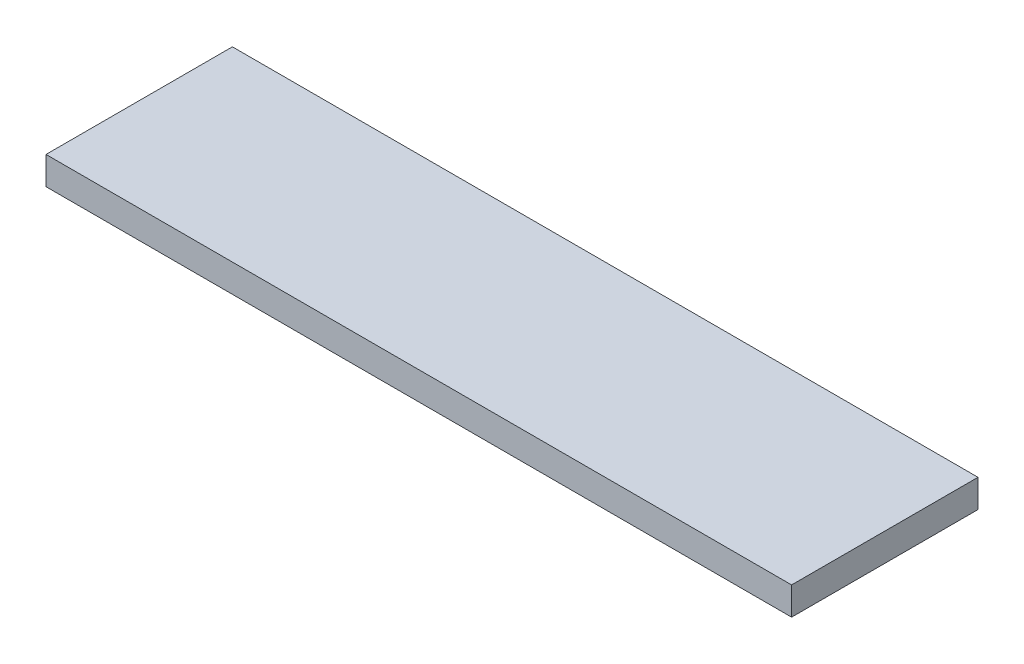
ISO-10303-21;
HEADER;
FILE_DESCRIPTION(('STEP AP214'),'2;1');
FILE_NAME('part.step','',(''),(''),'','','');
FILE_SCHEMA(('AUTOMOTIVE_DESIGN { 1 0 10303 214 1 1 1 1 }'));
ENDSEC;
DATA;
#1=APPLICATION_CONTEXT('core data for automotive mechanical design processes');
#2=APPLICATION_PROTOCOL_DEFINITION('international standard','automotive_design',2000,#1);
#3=PRODUCT_CONTEXT('',#1,'mechanical');
#4=PRODUCT('Part','Part','',(#3));
#5=PRODUCT_RELATED_PRODUCT_CATEGORY('part','',(#4));
#6=PRODUCT_DEFINITION_FORMATION('','',#4);
#7=PRODUCT_DEFINITION_CONTEXT('part definition',#1,'design');
#8=PRODUCT_DEFINITION('design','',#6,#7);
#9=PRODUCT_DEFINITION_SHAPE('','',#8);
#10=(LENGTH_UNIT() NAMED_UNIT(*) SI_UNIT(.MILLI.,.METRE.));
#11=(NAMED_UNIT(*) PLANE_ANGLE_UNIT() SI_UNIT($,.RADIAN.));
#12=(NAMED_UNIT(*) SI_UNIT($,.STERADIAN.) SOLID_ANGLE_UNIT());
#13=UNCERTAINTY_MEASURE_WITH_UNIT(LENGTH_MEASURE(1.E-05),#10,'distance_accuracy_value','');
#14=(GEOMETRIC_REPRESENTATION_CONTEXT(3) GLOBAL_UNCERTAINTY_ASSIGNED_CONTEXT((#13)) GLOBAL_UNIT_ASSIGNED_CONTEXT((#10,
#11,#12)) REPRESENTATION_CONTEXT('',''));
#15=CARTESIAN_POINT('',(0.,0.,0.));
#16=DIRECTION('',(0.,0.,1.));
#17=DIRECTION('',(1.,0.,0.));
#18=AXIS2_PLACEMENT_3D('',#15,#16,#17);
#19=CARTESIAN_POINT('',(0.,15.,0.));
#20=DIRECTION('',(1.,0.,0.));
#21=DIRECTION('',(0.,0.,-1.));
#22=AXIS2_PLACEMENT_3D('',#19,#20,#21);
#23=PLANE('',#22);
#24=DIRECTION('',(0.,0.,1.));
#25=VECTOR('',#24,1.);
#26=CARTESIAN_POINT('',(0.,0.,0.));
#27=LINE('',#26,#25);
#28=CARTESIAN_POINT('',(0.,0.,-100.));
#29=VERTEX_POINT('',#28);
#30=CARTESIAN_POINT('',(0.,0.,0.));
#31=VERTEX_POINT('',#30);
#32=EDGE_CURVE('E104',#29,#31,#27,.T.);
#33=ORIENTED_EDGE('',*,*,#32,.T.);
#34=DIRECTION('',(0.,-1.,0.));
#35=VECTOR('',#34,1.);
#36=CARTESIAN_POINT('',(0.,15.,0.));
#37=LINE('',#36,#35);
#38=CARTESIAN_POINT('',(0.,15.,0.));
#39=VERTEX_POINT('',#38);
#40=EDGE_CURVE('E11',#39,#31,#37,.T.);
#41=ORIENTED_EDGE('',*,*,#40,.F.);
#42=DIRECTION('',(0.,0.,1.));
#43=VECTOR('',#42,1.);
#44=CARTESIAN_POINT('',(0.,15.,0.));
#45=LINE('',#44,#43);
#46=CARTESIAN_POINT('',(0.,15.,-100.));
#47=VERTEX_POINT('',#46);
#48=EDGE_CURVE('E92',#47,#39,#45,.T.);
#49=ORIENTED_EDGE('',*,*,#48,.F.);
#50=DIRECTION('',(0.,-1.,0.));
#51=VECTOR('',#50,1.);
#52=CARTESIAN_POINT('',(0.,15.,-100.));
#53=LINE('',#52,#51);
#54=EDGE_CURVE('E100',#47,#29,#53,.T.);
#55=ORIENTED_EDGE('',*,*,#54,.T.);
#56=EDGE_LOOP('',(#33,#41,#49,#55));
#57=FACE_BOUND('',#56,.T.);
#58=ADVANCED_FACE('F41',(#57),#23,.F.);
#59=CARTESIAN_POINT('',(0.,15.,0.));
#60=DIRECTION('',(0.,0.,-1.));
#61=DIRECTION('',(-1.,0.,0.));
#62=AXIS2_PLACEMENT_3D('',#59,#60,#61);
#63=PLANE('',#62);
#64=DIRECTION('',(1.,0.,0.));
#65=VECTOR('',#64,1.);
#66=CARTESIAN_POINT('',(0.,0.,0.));
#67=LINE('',#66,#65);
#68=CARTESIAN_POINT('',(400.,0.,0.));
#69=VERTEX_POINT('',#68);
#70=EDGE_CURVE('E96',#31,#69,#67,.T.);
#71=ORIENTED_EDGE('',*,*,#70,.T.);
#72=DIRECTION('',(0.,-1.,0.));
#73=VECTOR('',#72,1.);
#74=CARTESIAN_POINT('',(400.,15.,0.));
#75=LINE('',#74,#73);
#76=CARTESIAN_POINT('',(400.,15.,0.));
#77=VERTEX_POINT('',#76);
#78=EDGE_CURVE('E49',#77,#69,#75,.T.);
#79=ORIENTED_EDGE('',*,*,#78,.F.);
#80=DIRECTION('',(1.,0.,0.));
#81=VECTOR('',#80,1.);
#82=CARTESIAN_POINT('',(0.,15.,0.));
#83=LINE('',#82,#81);
#84=EDGE_CURVE('E87',#39,#77,#83,.T.);
#85=ORIENTED_EDGE('',*,*,#84,.F.);
#86=ORIENTED_EDGE('',*,*,#40,.T.);
#87=EDGE_LOOP('',(#71,#79,#85,#86));
#88=FACE_BOUND('',#87,.T.);
#89=ADVANCED_FACE('F95',(#88),#63,.F.);
#90=CARTESIAN_POINT('',(400.,15.,0.));
#91=DIRECTION('',(-1.,0.,0.));
#92=DIRECTION('',(0.,0.,1.));
#93=AXIS2_PLACEMENT_3D('',#90,#91,#92);
#94=PLANE('',#93);
#95=DIRECTION('',(0.,0.,-1.));
#96=VECTOR('',#95,1.);
#97=CARTESIAN_POINT('',(400.,0.,0.));
#98=LINE('',#97,#96);
#99=CARTESIAN_POINT('',(400.,0.,-100.));
#100=VERTEX_POINT('',#99);
#101=EDGE_CURVE('E74',#69,#100,#98,.T.);
#102=ORIENTED_EDGE('',*,*,#101,.T.);
#103=DIRECTION('',(0.,-1.,0.));
#104=VECTOR('',#103,1.);
#105=CARTESIAN_POINT('',(400.,15.,-100.));
#106=LINE('',#105,#104);
#107=CARTESIAN_POINT('',(400.,15.,-100.));
#108=VERTEX_POINT('',#107);
#109=EDGE_CURVE('E97',#108,#100,#106,.T.);
#110=ORIENTED_EDGE('',*,*,#109,.F.);
#111=DIRECTION('',(0.,0.,-1.));
#112=VECTOR('',#111,1.);
#113=CARTESIAN_POINT('',(400.,15.,0.));
#114=LINE('',#113,#112);
#115=EDGE_CURVE('E90',#77,#108,#114,.T.);
#116=ORIENTED_EDGE('',*,*,#115,.F.);
#117=ORIENTED_EDGE('',*,*,#78,.T.);
#118=EDGE_LOOP('',(#102,#110,#116,#117));
#119=FACE_BOUND('',#118,.T.);
#120=ADVANCED_FACE('F98',(#119),#94,.F.);
#121=CARTESIAN_POINT('',(0.,15.,-100.));
#122=DIRECTION('',(0.,0.,1.));
#123=DIRECTION('',(1.,0.,0.));
#124=AXIS2_PLACEMENT_3D('',#121,#122,#123);
#125=PLANE('',#124);
#126=DIRECTION('',(-1.,0.,0.));
#127=VECTOR('',#126,1.);
#128=CARTESIAN_POINT('',(0.,0.,-100.));
#129=LINE('',#128,#127);
#130=EDGE_CURVE('E80',#100,#29,#129,.T.);
#131=ORIENTED_EDGE('',*,*,#130,.T.);
#132=ORIENTED_EDGE('',*,*,#54,.F.);
#133=DIRECTION('',(-1.,0.,0.));
#134=VECTOR('',#133,1.);
#135=CARTESIAN_POINT('',(0.,15.,-100.));
#136=LINE('',#135,#134);
#137=EDGE_CURVE('E57',#108,#47,#136,.T.);
#138=ORIENTED_EDGE('',*,*,#137,.F.);
#139=ORIENTED_EDGE('',*,*,#109,.T.);
#140=EDGE_LOOP('',(#131,#132,#138,#139));
#141=FACE_BOUND('',#140,.T.);
#142=ADVANCED_FACE('F111',(#141),#125,.F.);
#143=CARTESIAN_POINT('',(0.,15.,0.));
#144=DIRECTION('',(0.,-1.,0.));
#145=DIRECTION('',(0.,0.,-1.));
#146=AXIS2_PLACEMENT_3D('',#143,#144,#145);
#147=PLANE('',#146);
#148=ORIENTED_EDGE('',*,*,#48,.T.);
#149=ORIENTED_EDGE('',*,*,#84,.T.);
#150=ORIENTED_EDGE('',*,*,#115,.T.);
#151=ORIENTED_EDGE('',*,*,#137,.T.);
#152=EDGE_LOOP('',(#148,#149,#150,#151));
#153=FACE_BOUND('',#152,.T.);
#154=ADVANCED_FACE('F88',(#153),#147,.F.);
#155=CARTESIAN_POINT('',(0.,0.,0.));
#156=DIRECTION('',(0.,-1.,0.));
#157=DIRECTION('',(0.,0.,-1.));
#158=AXIS2_PLACEMENT_3D('',#155,#156,#157);
#159=PLANE('',#158);
#160=ORIENTED_EDGE('',*,*,#32,.F.);
#161=ORIENTED_EDGE('',*,*,#130,.F.);
#162=ORIENTED_EDGE('',*,*,#101,.F.);
#163=ORIENTED_EDGE('',*,*,#70,.F.);
#164=EDGE_LOOP('',(#160,#161,#162,#163));
#165=FACE_BOUND('',#164,.T.);
#166=ADVANCED_FACE('F114',(#165),#159,.T.);
#167=CLOSED_SHELL('',(#58,#89,#120,#142,#154,#166));
#168=MANIFOLD_SOLID_BREP('B2',#167);
#169=ADVANCED_BREP_SHAPE_REPRESENTATION('',(#18,#168),#14);
#170=SHAPE_DEFINITION_REPRESENTATION(#9,#169);
ENDSEC;
END-ISO-10303-21;
